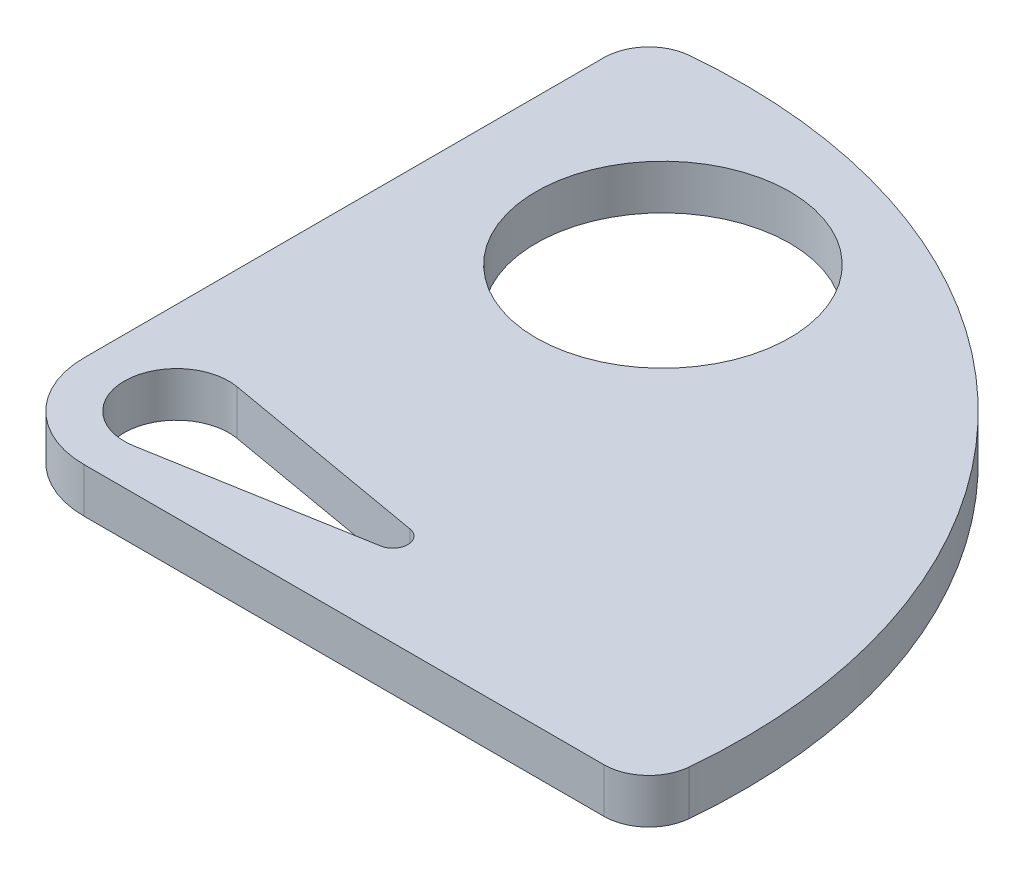
ISO-10303-21;
HEADER;
FILE_DESCRIPTION(('STEP AP214'),'2;1');
FILE_NAME('part.step','',(''),(''),'','','');
FILE_SCHEMA(('AUTOMOTIVE_DESIGN { 1 0 10303 214 1 1 1 1 }'));
ENDSEC;
DATA;
#1=APPLICATION_CONTEXT('core data for automotive mechanical design processes');
#2=APPLICATION_PROTOCOL_DEFINITION('international standard','automotive_design',2000,#1);
#3=PRODUCT_CONTEXT('',#1,'mechanical');
#4=PRODUCT('Part','Part','',(#3));
#5=PRODUCT_RELATED_PRODUCT_CATEGORY('part','',(#4));
#6=PRODUCT_DEFINITION_FORMATION('','',#4);
#7=PRODUCT_DEFINITION_CONTEXT('part definition',#1,'design');
#8=PRODUCT_DEFINITION('design','',#6,#7);
#9=PRODUCT_DEFINITION_SHAPE('','',#8);
#10=(LENGTH_UNIT() NAMED_UNIT(*) SI_UNIT(.MILLI.,.METRE.));
#11=(NAMED_UNIT(*) PLANE_ANGLE_UNIT() SI_UNIT($,.RADIAN.));
#12=(NAMED_UNIT(*) SI_UNIT($,.STERADIAN.) SOLID_ANGLE_UNIT());
#13=UNCERTAINTY_MEASURE_WITH_UNIT(LENGTH_MEASURE(1.E-05),#10,'distance_accuracy_value','');
#14=(GEOMETRIC_REPRESENTATION_CONTEXT(3) GLOBAL_UNCERTAINTY_ASSIGNED_CONTEXT((#13)) GLOBAL_UNIT_ASSIGNED_CONTEXT((#10,
#11,#12)) REPRESENTATION_CONTEXT('',''));
#15=CARTESIAN_POINT('',(0.,0.,0.));
#16=DIRECTION('',(0.,0.,1.));
#17=DIRECTION('',(1.,0.,0.));
#18=AXIS2_PLACEMENT_3D('',#15,#16,#17);
#19=CARTESIAN_POINT('',(-12.,3.,45.));
#20=DIRECTION('',(0.,1.,0.));
#21=DIRECTION('',(0.,0.,1.));
#22=AXIS2_PLACEMENT_3D('',#19,#20,#21);
#23=PLANE('',#22);
#24=CARTESIAN_POINT('',(-4.2,3.,20.1975807631594));
#25=DIRECTION('',(0.,1.,0.));
#26=DIRECTION('',(0.,0.,1.));
#27=AXIS2_PLACEMENT_3D('',#24,#25,#26);
#28=CIRCLE('',#27,8.5);
#29=CARTESIAN_POINT('',(-4.2,3.,28.6975807631594));
#30=VERTEX_POINT('',#29);
#31=EDGE_CURVE('E154',#30,#30,#28,.T.);
#32=ORIENTED_EDGE('',*,*,#31,.F.);
#33=EDGE_LOOP('',(#32));
#34=FACE_BOUND('',#33,.T.);
#35=DIRECTION('',(1.,0.,0.));
#36=VECTOR('',#35,1.);
#37=CARTESIAN_POINT('',(-12.,3.,51.2));
#38=LINE('',#37,#36);
#39=CARTESIAN_POINT('',(-12.,3.,51.2));
#40=VERTEX_POINT('',#39);
#41=CARTESIAN_POINT('',(22.8534072939792,3.,51.2));
#42=VERTEX_POINT('',#41);
#43=EDGE_CURVE('E163',#40,#42,#38,.T.);
#44=ORIENTED_EDGE('',*,*,#43,.T.);
#45=CARTESIAN_POINT('',(22.8534072939792,3.,48.2));
#46=DIRECTION('',(0.,1.,0.));
#47=DIRECTION('',(0.,0.,1.));
#48=AXIS2_PLACEMENT_3D('',#45,#46,#47);
#49=CIRCLE('',#48,3.);
#50=CARTESIAN_POINT('',(25.8408422048917,3.,48.4742857142857));
#51=VERTEX_POINT('',#50);
#52=EDGE_CURVE('E41',#42,#51,#49,.T.);
#53=ORIENTED_EDGE('',*,*,#52,.T.);
#54=CARTESIAN_POINT('',(-12.,3.,45.));
#55=DIRECTION('',(0.,1.,0.));
#56=DIRECTION('',(0.,0.,1.));
#57=AXIS2_PLACEMENT_3D('',#54,#55,#56);
#58=CIRCLE('',#57,38.);
#59=CARTESIAN_POINT('',(-15.4742857142857,3.,7.15915779510833));
#60=VERTEX_POINT('',#59);
#61=EDGE_CURVE('E166',#51,#60,#58,.T.);
#62=ORIENTED_EDGE('',*,*,#61,.T.);
#63=CARTESIAN_POINT('',(-15.2,3.,10.1465927060208));
#64=DIRECTION('',(0.,1.,0.));
#65=DIRECTION('',(0.,0.,1.));
#66=AXIS2_PLACEMENT_3D('',#63,#64,#65);
#67=CIRCLE('',#66,3.);
#68=CARTESIAN_POINT('',(-18.2,3.,10.1465927060208));
#69=VERTEX_POINT('',#68);
#70=EDGE_CURVE('E48',#60,#69,#67,.T.);
#71=ORIENTED_EDGE('',*,*,#70,.T.);
#72=DIRECTION('',(0.,0.,1.));
#73=VECTOR('',#72,1.);
#74=CARTESIAN_POINT('',(-18.2,3.,7.50920112881028));
#75=LINE('',#74,#73);
#76=CARTESIAN_POINT('',(-18.2,3.,44.9999999999999));
#77=VERTEX_POINT('',#76);
#78=EDGE_CURVE('E168',#69,#77,#75,.T.);
#79=ORIENTED_EDGE('',*,*,#78,.T.);
#80=CARTESIAN_POINT('',(-12.,3.,45.));
#81=DIRECTION('',(0.,1.,0.));
#82=DIRECTION('',(0.,0.,1.));
#83=AXIS2_PLACEMENT_3D('',#80,#81,#82);
#84=CIRCLE('',#83,6.2);
#85=EDGE_CURVE('E160',#77,#40,#84,.T.);
#86=ORIENTED_EDGE('',*,*,#85,.T.);
#87=EDGE_LOOP('',(#44,#53,#62,#71,#79,#86));
#88=FACE_BOUND('',#87,.T.);
#89=DIRECTION('',(0.985024610833497,0.,-0.172413793103448));
#90=VECTOR('',#89,1.);
#91=CARTESIAN_POINT('',(-11.3965517241379,3.,48.4475861379172));
#92=LINE('',#91,#90);
#93=CARTESIAN_POINT('',(-11.3965517241379,3.,48.4475861379172));
#94=VERTEX_POINT('',#93);
#95=CARTESIAN_POINT('',(2.67241379310346,3.,45.9850246108335));
#96=VERTEX_POINT('',#95);
#97=EDGE_CURVE('E123',#94,#96,#92,.T.);
#98=ORIENTED_EDGE('',*,*,#97,.F.);
#99=CARTESIAN_POINT('',(-12.,3.,45.));
#100=DIRECTION('',(0.,1.,0.));
#101=DIRECTION('',(0.,0.,1.));
#102=AXIS2_PLACEMENT_3D('',#99,#100,#101);
#103=CIRCLE('',#102,3.5);
#104=CARTESIAN_POINT('',(-11.3965517241379,3.,41.5524138620828));
#105=VERTEX_POINT('',#104);
#106=EDGE_CURVE('E112',#105,#94,#103,.T.);
#107=ORIENTED_EDGE('',*,*,#106,.F.);
#108=DIRECTION('',(0.985024610833497,0.,0.172413793103448));
#109=VECTOR('',#108,1.);
#110=CARTESIAN_POINT('',(-11.3965517241379,3.,41.5524138620828));
#111=LINE('',#110,#109);
#112=CARTESIAN_POINT('',(2.67241379310346,3.,44.0149753891665));
#113=VERTEX_POINT('',#112);
#114=EDGE_CURVE('E138',#105,#113,#111,.T.);
#115=ORIENTED_EDGE('',*,*,#114,.T.);
#116=CARTESIAN_POINT('',(2.50000000000001,3.,45.));
#117=DIRECTION('',(0.,1.,0.));
#118=DIRECTION('',(0.,0.,1.));
#119=AXIS2_PLACEMENT_3D('',#116,#117,#118);
#120=CIRCLE('',#119,0.999999999999999);
#121=EDGE_CURVE('E136',#96,#113,#120,.T.);
#122=ORIENTED_EDGE('',*,*,#121,.F.);
#123=EDGE_LOOP('',(#98,#107,#115,#122));
#124=FACE_BOUND('',#123,.T.);
#125=ADVANCED_FACE('F33',(#34,#88,#124),#23,.T.);
#126=CARTESIAN_POINT('',(-12.,0.,45.));
#127=DIRECTION('',(0.,1.,0.));
#128=DIRECTION('',(0.,0.,1.));
#129=AXIS2_PLACEMENT_3D('',#126,#127,#128);
#130=PLANE('',#129);
#131=CARTESIAN_POINT('',(-4.2,0.,20.1975807631594));
#132=DIRECTION('',(0.,1.,0.));
#133=DIRECTION('',(0.,0.,1.));
#134=AXIS2_PLACEMENT_3D('',#131,#132,#133);
#135=CIRCLE('',#134,8.5);
#136=CARTESIAN_POINT('',(-4.2,0.,28.6975807631594));
#137=VERTEX_POINT('',#136);
#138=EDGE_CURVE('E131',#137,#137,#135,.T.);
#139=ORIENTED_EDGE('',*,*,#138,.T.);
#140=EDGE_LOOP('',(#139));
#141=FACE_BOUND('',#140,.T.);
#142=CARTESIAN_POINT('',(-12.,0.,45.));
#143=DIRECTION('',(0.,1.,0.));
#144=DIRECTION('',(0.,0.,1.));
#145=AXIS2_PLACEMENT_3D('',#142,#143,#144);
#146=CIRCLE('',#145,38.);
#147=CARTESIAN_POINT('',(25.8408422048917,0.,48.4742857142857));
#148=VERTEX_POINT('',#147);
#149=CARTESIAN_POINT('',(-15.4742857142857,0.,7.15915779510833));
#150=VERTEX_POINT('',#149);
#151=EDGE_CURVE('E175',#148,#150,#146,.T.);
#152=ORIENTED_EDGE('',*,*,#151,.F.);
#153=CARTESIAN_POINT('',(22.8534072939792,0.,48.2));
#154=DIRECTION('',(0.,1.,0.));
#155=DIRECTION('',(0.,0.,1.));
#156=AXIS2_PLACEMENT_3D('',#153,#154,#155);
#157=CIRCLE('',#156,3.);
#158=CARTESIAN_POINT('',(22.8534072939792,0.,51.2));
#159=VERTEX_POINT('',#158);
#160=EDGE_CURVE('E191',#148,#159,#157,.F.);
#161=ORIENTED_EDGE('',*,*,#160,.T.);
#162=DIRECTION('',(1.,0.,0.));
#163=VECTOR('',#162,1.);
#164=CARTESIAN_POINT('',(-12.,0.,51.2));
#165=LINE('',#164,#163);
#166=CARTESIAN_POINT('',(-12.,0.,51.2));
#167=VERTEX_POINT('',#166);
#168=EDGE_CURVE('E173',#167,#159,#165,.T.);
#169=ORIENTED_EDGE('',*,*,#168,.F.);
#170=CARTESIAN_POINT('',(-12.,0.,45.));
#171=DIRECTION('',(0.,1.,0.));
#172=DIRECTION('',(0.,0.,1.));
#173=AXIS2_PLACEMENT_3D('',#170,#171,#172);
#174=CIRCLE('',#173,6.2);
#175=CARTESIAN_POINT('',(-18.2,0.,44.9999999999999));
#176=VERTEX_POINT('',#175);
#177=EDGE_CURVE('E157',#176,#167,#174,.T.);
#178=ORIENTED_EDGE('',*,*,#177,.F.);
#179=DIRECTION('',(0.,0.,1.));
#180=VECTOR('',#179,1.);
#181=CARTESIAN_POINT('',(-18.2,0.,7.50920112881028));
#182=LINE('',#181,#180);
#183=CARTESIAN_POINT('',(-18.2,0.,10.1465927060208));
#184=VERTEX_POINT('',#183);
#185=EDGE_CURVE('E164',#184,#176,#182,.T.);
#186=ORIENTED_EDGE('',*,*,#185,.F.);
#187=CARTESIAN_POINT('',(-15.2,0.,10.1465927060208));
#188=DIRECTION('',(0.,1.,0.));
#189=DIRECTION('',(0.,0.,1.));
#190=AXIS2_PLACEMENT_3D('',#187,#188,#189);
#191=CIRCLE('',#190,3.);
#192=EDGE_CURVE('E189',#184,#150,#191,.F.);
#193=ORIENTED_EDGE('',*,*,#192,.T.);
#194=EDGE_LOOP('',(#152,#161,#169,#178,#186,#193));
#195=FACE_BOUND('',#194,.T.);
#196=CARTESIAN_POINT('',(-12.,0.,45.));
#197=DIRECTION('',(0.,1.,0.));
#198=DIRECTION('',(0.,0.,1.));
#199=AXIS2_PLACEMENT_3D('',#196,#197,#198);
#200=CIRCLE('',#199,3.5);
#201=CARTESIAN_POINT('',(-11.3965517241379,0.,41.5524138620828));
#202=VERTEX_POINT('',#201);
#203=CARTESIAN_POINT('',(-11.3965517241379,0.,48.4475861379172));
#204=VERTEX_POINT('',#203);
#205=EDGE_CURVE('E142',#202,#204,#200,.T.);
#206=ORIENTED_EDGE('',*,*,#205,.T.);
#207=DIRECTION('',(0.985024610833497,0.,-0.172413793103448));
#208=VECTOR('',#207,1.);
#209=CARTESIAN_POINT('',(-11.3965517241379,0.,48.4475861379172));
#210=LINE('',#209,#208);
#211=CARTESIAN_POINT('',(2.67241379310346,0.,45.9850246108335));
#212=VERTEX_POINT('',#211);
#213=EDGE_CURVE('E130',#204,#212,#210,.T.);
#214=ORIENTED_EDGE('',*,*,#213,.T.);
#215=CARTESIAN_POINT('',(2.50000000000001,0.,45.));
#216=DIRECTION('',(0.,1.,0.));
#217=DIRECTION('',(0.,0.,1.));
#218=AXIS2_PLACEMENT_3D('',#215,#216,#217);
#219=CIRCLE('',#218,0.999999999999999);
#220=CARTESIAN_POINT('',(2.67241379310346,0.,44.0149753891665));
#221=VERTEX_POINT('',#220);
#222=EDGE_CURVE('E145',#212,#221,#219,.T.);
#223=ORIENTED_EDGE('',*,*,#222,.T.);
#224=DIRECTION('',(0.985024610833497,0.,0.172413793103448));
#225=VECTOR('',#224,1.);
#226=CARTESIAN_POINT('',(-11.3965517241379,0.,41.5524138620828));
#227=LINE('',#226,#225);
#228=EDGE_CURVE('E124',#202,#221,#227,.T.);
#229=ORIENTED_EDGE('',*,*,#228,.F.);
#230=EDGE_LOOP('',(#206,#214,#223,#229));
#231=FACE_BOUND('',#230,.T.);
#232=ADVANCED_FACE('F204',(#141,#195,#231),#130,.F.);
#233=CARTESIAN_POINT('',(-12.,3.,45.));
#234=DIRECTION('',(0.,-1.,0.));
#235=DIRECTION('',(0.,0.,-1.));
#236=AXIS2_PLACEMENT_3D('',#233,#234,#235);
#237=CYLINDRICAL_SURFACE('',#236,6.2);
#238=ORIENTED_EDGE('',*,*,#177,.T.);
#239=DIRECTION('',(0.,-1.,0.));
#240=VECTOR('',#239,1.);
#241=CARTESIAN_POINT('',(-12.,3.,51.2));
#242=LINE('',#241,#240);
#243=EDGE_CURVE('E181',#40,#167,#242,.T.);
#244=ORIENTED_EDGE('',*,*,#243,.F.);
#245=ORIENTED_EDGE('',*,*,#85,.F.);
#246=DIRECTION('',(0.,-1.,0.));
#247=VECTOR('',#246,1.);
#248=CARTESIAN_POINT('',(-18.2,3.,44.9999999999999));
#249=LINE('',#248,#247);
#250=EDGE_CURVE('E170',#77,#176,#249,.T.);
#251=ORIENTED_EDGE('',*,*,#250,.T.);
#252=EDGE_LOOP('',(#238,#244,#245,#251));
#253=FACE_BOUND('',#252,.T.);
#254=ADVANCED_FACE('F211',(#253),#237,.T.);
#255=CARTESIAN_POINT('',(-12.,3.,51.2));
#256=DIRECTION('',(0.,0.,-1.));
#257=DIRECTION('',(-1.,0.,0.));
#258=AXIS2_PLACEMENT_3D('',#255,#256,#257);
#259=PLANE('',#258);
#260=ORIENTED_EDGE('',*,*,#168,.T.);
#261=DIRECTION('',(0.,-1.,0.));
#262=VECTOR('',#261,1.);
#263=CARTESIAN_POINT('',(22.8534072939792,3.,51.2));
#264=LINE('',#263,#262);
#265=EDGE_CURVE('E56',#159,#42,#264,.F.);
#266=ORIENTED_EDGE('',*,*,#265,.T.);
#267=ORIENTED_EDGE('',*,*,#43,.F.);
#268=ORIENTED_EDGE('',*,*,#243,.T.);
#269=EDGE_LOOP('',(#260,#266,#267,#268));
#270=FACE_BOUND('',#269,.T.);
#271=ADVANCED_FACE('F207',(#270),#259,.F.);
#272=CARTESIAN_POINT('',(-12.,3.,45.));
#273=DIRECTION('',(0.,-1.,0.));
#274=DIRECTION('',(0.,0.,-1.));
#275=AXIS2_PLACEMENT_3D('',#272,#273,#274);
#276=CYLINDRICAL_SURFACE('',#275,38.);
#277=ORIENTED_EDGE('',*,*,#61,.F.);
#278=DIRECTION('',(0.,-1.,0.));
#279=VECTOR('',#278,1.);
#280=CARTESIAN_POINT('',(25.8408422048917,3.,48.4742857142857));
#281=LINE('',#280,#279);
#282=EDGE_CURVE('E186',#51,#148,#281,.T.);
#283=ORIENTED_EDGE('',*,*,#282,.T.);
#284=ORIENTED_EDGE('',*,*,#151,.T.);
#285=DIRECTION('',(0.,-1.,0.));
#286=VECTOR('',#285,1.);
#287=CARTESIAN_POINT('',(-15.4742857142857,3.,7.15915779510833));
#288=LINE('',#287,#286);
#289=EDGE_CURVE('E184',#150,#60,#288,.F.);
#290=ORIENTED_EDGE('',*,*,#289,.T.);
#291=EDGE_LOOP('',(#277,#283,#284,#290));
#292=FACE_BOUND('',#291,.T.);
#293=ADVANCED_FACE('F199',(#292),#276,.T.);
#294=CARTESIAN_POINT('',(-18.2,3.,7.50920112881028));
#295=DIRECTION('',(1.,0.,0.));
#296=DIRECTION('',(0.,0.,-1.));
#297=AXIS2_PLACEMENT_3D('',#294,#295,#296);
#298=PLANE('',#297);
#299=ORIENTED_EDGE('',*,*,#78,.F.);
#300=DIRECTION('',(0.,-1.,0.));
#301=VECTOR('',#300,1.);
#302=CARTESIAN_POINT('',(-18.2,3.,10.1465927060208));
#303=LINE('',#302,#301);
#304=EDGE_CURVE('E11',#69,#184,#303,.T.);
#305=ORIENTED_EDGE('',*,*,#304,.T.);
#306=ORIENTED_EDGE('',*,*,#185,.T.);
#307=ORIENTED_EDGE('',*,*,#250,.F.);
#308=EDGE_LOOP('',(#299,#305,#306,#307));
#309=FACE_BOUND('',#308,.T.);
#310=ADVANCED_FACE('F215',(#309),#298,.F.);
#311=CARTESIAN_POINT('',(-4.2,3.,20.1975807631594));
#312=DIRECTION('',(0.,-1.,0.));
#313=DIRECTION('',(0.,0.,-1.));
#314=AXIS2_PLACEMENT_3D('',#311,#312,#313);
#315=CYLINDRICAL_SURFACE('',#314,8.5);
#316=ORIENTED_EDGE('',*,*,#31,.T.);
#317=EDGE_LOOP('',(#316));
#318=FACE_BOUND('',#317,.T.);
#319=ORIENTED_EDGE('',*,*,#138,.F.);
#320=EDGE_LOOP('',(#319));
#321=FACE_BOUND('',#320,.T.);
#322=ADVANCED_FACE('F234',(#318,#321),#315,.F.);
#323=CARTESIAN_POINT('',(-12.,3.,45.));
#324=DIRECTION('',(0.,-1.,0.));
#325=DIRECTION('',(0.,0.,-1.));
#326=AXIS2_PLACEMENT_3D('',#323,#324,#325);
#327=CYLINDRICAL_SURFACE('',#326,3.5);
#328=ORIENTED_EDGE('',*,*,#205,.F.);
#329=DIRECTION('',(0.,-1.,0.));
#330=VECTOR('',#329,1.);
#331=CARTESIAN_POINT('',(-11.3965517241379,3.,41.5524138620828));
#332=LINE('',#331,#330);
#333=EDGE_CURVE('E118',#105,#202,#332,.T.);
#334=ORIENTED_EDGE('',*,*,#333,.F.);
#335=ORIENTED_EDGE('',*,*,#106,.T.);
#336=DIRECTION('',(0.,-1.,0.));
#337=VECTOR('',#336,1.);
#338=CARTESIAN_POINT('',(-11.3965517241379,3.,48.4475861379172));
#339=LINE('',#338,#337);
#340=EDGE_CURVE('E115',#94,#204,#339,.T.);
#341=ORIENTED_EDGE('',*,*,#340,.T.);
#342=EDGE_LOOP('',(#328,#334,#335,#341));
#343=FACE_BOUND('',#342,.T.);
#344=ADVANCED_FACE('F114',(#343),#327,.F.);
#345=CARTESIAN_POINT('',(-11.3965517241379,3.,48.4475861379172));
#346=DIRECTION('',(-0.172413793103448,0.,-0.985024610833497));
#347=DIRECTION('',(-0.985024610833497,0.,0.172413793103448));
#348=AXIS2_PLACEMENT_3D('',#345,#346,#347);
#349=PLANE('',#348);
#350=ORIENTED_EDGE('',*,*,#213,.F.);
#351=ORIENTED_EDGE('',*,*,#340,.F.);
#352=ORIENTED_EDGE('',*,*,#97,.T.);
#353=DIRECTION('',(0.,-1.,0.));
#354=VECTOR('',#353,1.);
#355=CARTESIAN_POINT('',(2.67241379310346,3.,45.9850246108335));
#356=LINE('',#355,#354);
#357=EDGE_CURVE('E132',#96,#212,#356,.T.);
#358=ORIENTED_EDGE('',*,*,#357,.T.);
#359=EDGE_LOOP('',(#350,#351,#352,#358));
#360=FACE_BOUND('',#359,.T.);
#361=ADVANCED_FACE('F127',(#360),#349,.T.);
#362=CARTESIAN_POINT('',(2.50000000000001,3.,45.));
#363=DIRECTION('',(0.,-1.,0.));
#364=DIRECTION('',(0.,0.,-1.));
#365=AXIS2_PLACEMENT_3D('',#362,#363,#364);
#366=CYLINDRICAL_SURFACE('',#365,0.999999999999999);
#367=ORIENTED_EDGE('',*,*,#222,.F.);
#368=ORIENTED_EDGE('',*,*,#357,.F.);
#369=ORIENTED_EDGE('',*,*,#121,.T.);
#370=DIRECTION('',(0.,-1.,0.));
#371=VECTOR('',#370,1.);
#372=CARTESIAN_POINT('',(2.67241379310346,3.,44.0149753891665));
#373=LINE('',#372,#371);
#374=EDGE_CURVE('E151',#113,#221,#373,.T.);
#375=ORIENTED_EDGE('',*,*,#374,.T.);
#376=EDGE_LOOP('',(#367,#368,#369,#375));
#377=FACE_BOUND('',#376,.T.);
#378=ADVANCED_FACE('F285',(#377),#366,.F.);
#379=CARTESIAN_POINT('',(-11.3965517241379,3.,41.5524138620828));
#380=DIRECTION('',(0.172413793103448,0.,-0.985024610833497));
#381=DIRECTION('',(-0.985024610833497,0.,-0.172413793103448));
#382=AXIS2_PLACEMENT_3D('',#379,#380,#381);
#383=PLANE('',#382);
#384=ORIENTED_EDGE('',*,*,#228,.T.);
#385=ORIENTED_EDGE('',*,*,#374,.F.);
#386=ORIENTED_EDGE('',*,*,#114,.F.);
#387=ORIENTED_EDGE('',*,*,#333,.T.);
#388=EDGE_LOOP('',(#384,#385,#386,#387));
#389=FACE_BOUND('',#388,.T.);
#390=ADVANCED_FACE('F222',(#389),#383,.F.);
#391=CARTESIAN_POINT('',(22.8534072939792,3.,48.2));
#392=DIRECTION('',(0.,-1.,0.));
#393=DIRECTION('',(0.,0.,-1.));
#394=AXIS2_PLACEMENT_3D('',#391,#392,#393);
#395=CYLINDRICAL_SURFACE('',#394,3.);
#396=ORIENTED_EDGE('',*,*,#52,.F.);
#397=ORIENTED_EDGE('',*,*,#265,.F.);
#398=ORIENTED_EDGE('',*,*,#160,.F.);
#399=ORIENTED_EDGE('',*,*,#282,.F.);
#400=EDGE_LOOP('',(#396,#397,#398,#399));
#401=FACE_BOUND('',#400,.T.);
#402=ADVANCED_FACE('F202',(#401),#395,.T.);
#403=CARTESIAN_POINT('',(-15.2,3.,10.1465927060208));
#404=DIRECTION('',(0.,-1.,0.));
#405=DIRECTION('',(0.,0.,-1.));
#406=AXIS2_PLACEMENT_3D('',#403,#404,#405);
#407=CYLINDRICAL_SURFACE('',#406,3.);
#408=ORIENTED_EDGE('',*,*,#70,.F.);
#409=ORIENTED_EDGE('',*,*,#289,.F.);
#410=ORIENTED_EDGE('',*,*,#192,.F.);
#411=ORIENTED_EDGE('',*,*,#304,.F.);
#412=EDGE_LOOP('',(#408,#409,#410,#411));
#413=FACE_BOUND('',#412,.T.);
#414=ADVANCED_FACE('F35',(#413),#407,.T.);
#415=CLOSED_SHELL('',(#125,#232,#254,#271,#293,#310,#322,#344,#361,#378,#390,#402,#414));
#416=MANIFOLD_SOLID_BREP('B2',#415);
#417=ADVANCED_BREP_SHAPE_REPRESENTATION('',(#18,#416),#14);
#418=SHAPE_DEFINITION_REPRESENTATION(#9,#417);
ENDSEC;
END-ISO-10303-21;
